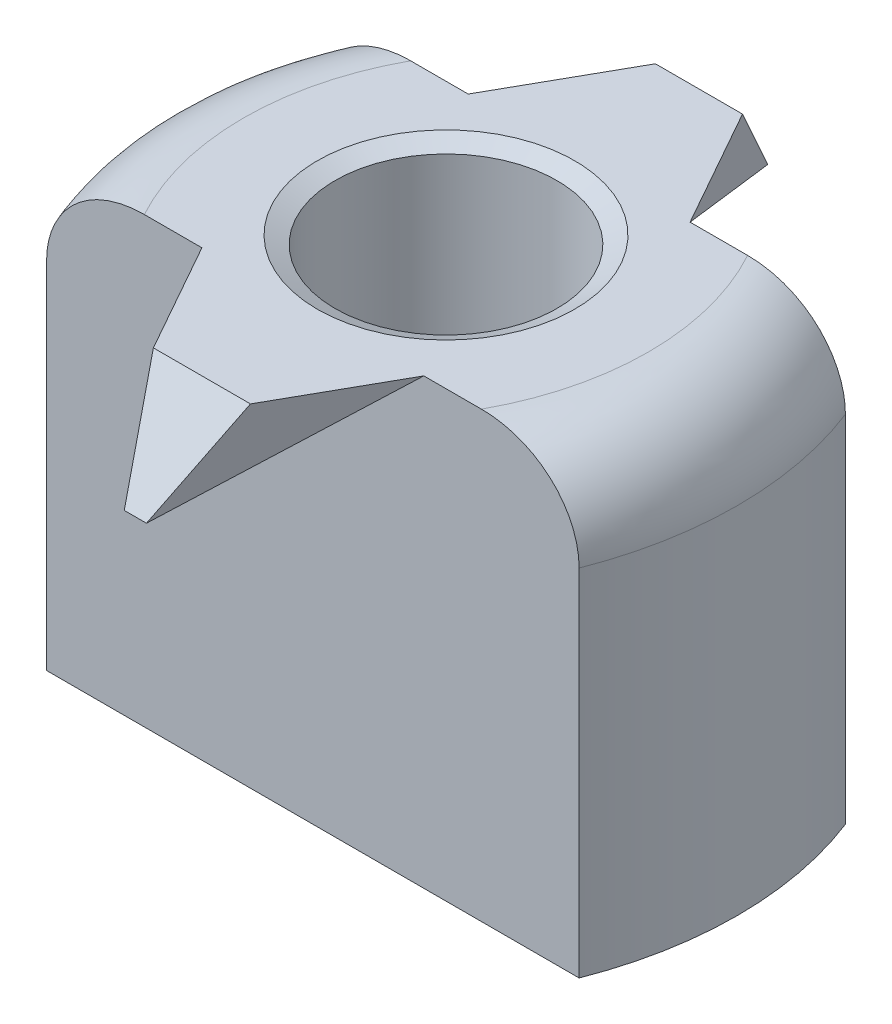
ISO-10303-21;
HEADER;
FILE_DESCRIPTION(('STEP AP214'),'2;1');
FILE_NAME('part.step','',(''),(''),'','','');
FILE_SCHEMA(('AUTOMOTIVE_DESIGN { 1 0 10303 214 1 1 1 1 }'));
ENDSEC;
DATA;
#1=APPLICATION_CONTEXT('core data for automotive mechanical design processes');
#2=APPLICATION_PROTOCOL_DEFINITION('international standard','automotive_design',2000,#1);
#3=PRODUCT_CONTEXT('',#1,'mechanical');
#4=PRODUCT('Part','Part','',(#3));
#5=PRODUCT_RELATED_PRODUCT_CATEGORY('part','',(#4));
#6=PRODUCT_DEFINITION_FORMATION('','',#4);
#7=PRODUCT_DEFINITION_CONTEXT('part definition',#1,'design');
#8=PRODUCT_DEFINITION('design','',#6,#7);
#9=PRODUCT_DEFINITION_SHAPE('','',#8);
#10=(LENGTH_UNIT() NAMED_UNIT(*) SI_UNIT(.MILLI.,.METRE.));
#11=(NAMED_UNIT(*) PLANE_ANGLE_UNIT() SI_UNIT($,.RADIAN.));
#12=(NAMED_UNIT(*) SI_UNIT($,.STERADIAN.) SOLID_ANGLE_UNIT());
#13=UNCERTAINTY_MEASURE_WITH_UNIT(LENGTH_MEASURE(1.E-05),#10,'distance_accuracy_value','');
#14=(GEOMETRIC_REPRESENTATION_CONTEXT(3) GLOBAL_UNCERTAINTY_ASSIGNED_CONTEXT((#13)) GLOBAL_UNIT_ASSIGNED_CONTEXT((#10,
#11,#12)) REPRESENTATION_CONTEXT('',''));
#15=CARTESIAN_POINT('',(0.,0.,0.));
#16=DIRECTION('',(0.,0.,1.));
#17=DIRECTION('',(1.,0.,0.));
#18=AXIS2_PLACEMENT_3D('',#15,#16,#17);
#19=CARTESIAN_POINT('',(2.00869459776592,8.,23.889910232699));
#20=DIRECTION('',(-0.871575537124549,0.,-0.49026123963256));
#21=DIRECTION('',(-0.490261239632559,0.,0.871575537124549));
#22=AXIS2_PLACEMENT_3D('',#19,#20,#21);
#23=PLANE('',#22);
#24=DIRECTION('',(-0.49026123963256,0.,0.871575537124549));
#25=VECTOR('',#24,1.);
#26=CARTESIAN_POINT('',(2.00869459776592,10.,23.889910232699));
#27=LINE('',#26,#25);
#28=CARTESIAN_POINT('',(7.35801361324972,10.,14.3800097607278));
#29=VERTEX_POINT('',#28);
#30=CARTESIAN_POINT('',(5.9517636132497,10.,16.8800097607279));
#31=VERTEX_POINT('',#30);
#32=EDGE_CURVE('E176',#29,#31,#27,.T.);
#33=ORIENTED_EDGE('',*,*,#32,.T.);
#34=DIRECTION('',(-0.319778644158178,-0.757993823189763,0.568495367392316));
#35=VECTOR('',#34,1.);
#36=CARTESIAN_POINT('',(3.78942270653598,4.87445118408593,20.7241713726634));
#37=LINE('',#36,#35);
#38=CARTESIAN_POINT('',(5.10801361324971,8.,18.3800097607278));
#39=VERTEX_POINT('',#38);
#40=EDGE_CURVE('E549',#31,#39,#37,.T.);
#41=ORIENTED_EDGE('',*,*,#40,.T.);
#42=DIRECTION('',(0.449438552495031,0.399500935551138,-0.799001871102275));
#43=VECTOR('',#42,1.);
#44=CARTESIAN_POINT('',(5.10801361324971,8.,18.3800097607278));
#45=LINE('',#44,#43);
#46=EDGE_CURVE('E164',#39,#29,#45,.T.);
#47=ORIENTED_EDGE('',*,*,#46,.T.);
#48=EDGE_LOOP('',(#33,#41,#47));
#49=FACE_BOUND('',#48,.T.);
#50=ADVANCED_FACE('F37',(#49),#23,.F.);
#51=CARTESIAN_POINT('',(0.,8.,22.7600195214557));
#52=DIRECTION('',(0.,1.,0.));
#53=DIRECTION('',(0.,0.,-1.));
#54=AXIS2_PLACEMENT_3D('',#51,#52,#53);
#55=PLANE('',#54);
#56=DIRECTION('',(-1.,0.,0.));
#57=VECTOR('',#56,1.);
#58=CARTESIAN_POINT('',(0.,8.,18.3800097607278));
#59=LINE('',#58,#57);
#60=CARTESIAN_POINT('',(4.60801361324971,8.,18.3800097607278));
#61=VERTEX_POINT('',#60);
#62=EDGE_CURVE('E144',#39,#61,#59,.T.);
#63=ORIENTED_EDGE('',*,*,#62,.T.);
#64=DIRECTION('',(0.,0.,1.));
#65=VECTOR('',#64,1.);
#66=CARTESIAN_POINT('',(4.60801361324972,8.,14.3800097607278));
#67=LINE('',#66,#65);
#68=CARTESIAN_POINT('',(4.60801361324972,8.,14.3800097607278));
#69=VERTEX_POINT('',#68);
#70=EDGE_CURVE('E156',#69,#61,#67,.T.);
#71=ORIENTED_EDGE('',*,*,#70,.F.);
#72=DIRECTION('',(-1.,0.,0.));
#73=VECTOR('',#72,1.);
#74=CARTESIAN_POINT('',(0.,8.,14.3800097607278));
#75=LINE('',#74,#73);
#76=CARTESIAN_POINT('',(5.10801361324972,8.,14.3800097607278));
#77=VERTEX_POINT('',#76);
#78=EDGE_CURVE('E172',#77,#69,#75,.T.);
#79=ORIENTED_EDGE('',*,*,#78,.F.);
#80=DIRECTION('',(0.,0.,1.));
#81=VECTOR('',#80,1.);
#82=CARTESIAN_POINT('',(5.10801361324972,8.,14.3800097607278));
#83=LINE('',#82,#81);
#84=EDGE_CURVE('E171',#77,#39,#83,.T.);
#85=ORIENTED_EDGE('',*,*,#84,.T.);
#86=EDGE_LOOP('',(#63,#71,#79,#85));
#87=FACE_BOUND('',#86,.T.);
#88=ADVANCED_FACE('F170',(#87),#55,.F.);
#89=CARTESIAN_POINT('',(0.,10.,14.3800097607278));
#90=DIRECTION('',(0.,0.,-1.));
#91=DIRECTION('',(-1.,0.,0.));
#92=AXIS2_PLACEMENT_3D('',#89,#90,#91);
#93=PLANE('',#92);
#94=DIRECTION('',(1.,0.,0.));
#95=VECTOR('',#94,1.);
#96=CARTESIAN_POINT('',(0.,10.,14.3800097607278));
#97=LINE('',#96,#95);
#98=CARTESIAN_POINT('',(1.06067829011155,10.,14.3800097607278));
#99=VERTEX_POINT('',#98);
#100=CARTESIAN_POINT('',(2.35801361324972,10.,14.3800097607278));
#101=VERTEX_POINT('',#100);
#102=EDGE_CURVE('E221',#99,#101,#97,.T.);
#103=ORIENTED_EDGE('',*,*,#102,.F.);
#104=CARTESIAN_POINT('',(1.06067829011155,10.,14.3800097607278));
#105=CARTESIAN_POINT('',(0.99276883689392,9.99999692601503,14.3800097607278));
#106=CARTESIAN_POINT('',(0.92488186949415,9.99733748987795,14.3800097607278));
#107=CARTESIAN_POINT('',(0.789507985505643,9.98657300168965,14.3800097607278));
#108=CARTESIAN_POINT('',(0.722021293302987,9.97846514174542,14.3800097607278));
#109=CARTESIAN_POINT('',(0.52034416207622,9.9456993105509,14.3800097607278));
#110=CARTESIAN_POINT('',(0.387403950018559,9.91259718921953,14.3800097607278));
#111=CARTESIAN_POINT('',(0.128937050575934,9.82342949452416,14.3800097607278));
#112=CARTESIAN_POINT('',(0.00343710516430207,9.76728623026918,14.3800097607278));
#113=CARTESIAN_POINT('',(-0.23475568878166,9.63267396275602,14.3800097607278));
#114=CARTESIAN_POINT('',(-0.347475288661054,9.55425284454722,14.3800097607278));
#115=CARTESIAN_POINT('',(-0.545654084046089,9.38515579847209,14.3800097607278));
#116=CARTESIAN_POINT('',(-0.63267696886292,9.29631242483982,14.3800097607278));
#117=CARTESIAN_POINT('',(-0.788821780296559,9.10396165368204,14.3800097607278));
#118=CARTESIAN_POINT('',(-0.857941879908584,9.00045276118558,14.3800097607278));
#119=CARTESIAN_POINT('',(-0.969851523633459,8.79194153031789,14.3800097607278));
#120=CARTESIAN_POINT('',(-1.01444435063803,8.68790251467548,14.3800097607278));
#121=CARTESIAN_POINT('',(-1.08433422877968,8.47363160828245,14.3800097607278));
#122=CARTESIAN_POINT('',(-1.10966733215311,8.36341170506273,14.3800097607278));
#123=CARTESIAN_POINT('',(-1.13057764239597,8.210183368668,14.3800097607278));
#124=CARTESIAN_POINT('',(-1.13485643257881,8.16822642104922,14.3800097607278));
#125=CARTESIAN_POINT('',(-1.14055727489586,8.08418663444331,14.3800097607278));
#126=CARTESIAN_POINT('',(-1.14198391054801,8.04210410646292,14.3800097607278));
#127=CARTESIAN_POINT('',(-1.14198638675049,8.00000000000003,14.3800097607278));
#128=B_SPLINE_CURVE_WITH_KNOTS('',3,(#104,#105,#106,#107,#108,#109,#110,#111,#112,#113,#114,
#115,#116,#117,#118,#119,#120,#121,#122,#123,#124,#125,#126,#127),.UNSPECIFIED.,.F.,.F.,(4,2,2,
2,2,2,2,2,2,2,2,4),(0.,0.203624834366503,0.407354689139029,0.816199548109344,1.22643444030561,
1.63579414124467,2.0068611863635,2.377966084497,2.71584732346191,3.05309451528966,
3.17954307435226,3.30578826202666),.UNSPECIFIED.);
#129=CARTESIAN_POINT('',(-1.14198638675029,8.,14.3800097607278));
#130=VERTEX_POINT('',#129);
#131=EDGE_CURVE('E236',#99,#130,#128,.T.);
#132=ORIENTED_EDGE('',*,*,#131,.T.);
#133=DIRECTION('',(0.,-1.,0.));
#134=VECTOR('',#133,1.);
#135=CARTESIAN_POINT('',(-1.14198638675029,10.,14.3800097607278));
#136=LINE('',#135,#134);
#137=CARTESIAN_POINT('',(-1.14198638675029,0.,14.3800097607278));
#138=VERTEX_POINT('',#137);
#139=EDGE_CURVE('E348',#130,#138,#136,.T.);
#140=ORIENTED_EDGE('',*,*,#139,.T.);
#141=DIRECTION('',(1.,0.,0.));
#142=VECTOR('',#141,1.);
#143=CARTESIAN_POINT('',(0.,0.,14.3800097607278));
#144=LINE('',#143,#142);
#145=CARTESIAN_POINT('',(10.8580136132497,0.,14.3800097607278));
#146=VERTEX_POINT('',#145);
#147=EDGE_CURVE('E340',#138,#146,#144,.T.);
#148=ORIENTED_EDGE('',*,*,#147,.T.);
#149=DIRECTION('',(0.,-1.,0.));
#150=VECTOR('',#149,1.);
#151=CARTESIAN_POINT('',(10.8580136132497,10.,14.3800097607278));
#152=LINE('',#151,#150);
#153=CARTESIAN_POINT('',(10.8580136132497,8.,14.3800097607278));
#154=VERTEX_POINT('',#153);
#155=EDGE_CURVE('E338',#154,#146,#152,.T.);
#156=ORIENTED_EDGE('',*,*,#155,.F.);
#157=CARTESIAN_POINT('',(10.8580136132497,8.,14.3800097607278));
#158=CARTESIAN_POINT('',(10.8580147380313,8.05327186211022,14.3800097607278));
#159=CARTESIAN_POINT('',(10.8557269651468,8.10651739083268,14.3800097607278));
#160=CARTESIAN_POINT('',(10.8466103537661,8.21261002598222,14.3800097607278));
#161=CARTESIAN_POINT('',(10.8397822208703,8.26545719302682,14.3800097607278));
#162=CARTESIAN_POINT('',(10.8125996787241,8.4225700623657,14.3800097607278));
#163=CARTESIAN_POINT('',(10.7855465724581,8.52575398372436,14.3800097607278));
#164=CARTESIAN_POINT('',(10.7145624841592,8.72605905107867,14.3800097607278));
#165=CARTESIAN_POINT('',(10.6706322116999,8.82318045176383,14.3800097607278));
#166=CARTESIAN_POINT('',(10.5674394402873,9.00892490803404,14.3800097607278));
#167=CARTESIAN_POINT('',(10.5081726640865,9.09754558335815,14.3800097607278));
#168=CARTESIAN_POINT('',(10.3747434638435,9.26612414393127,14.3800097607278));
#169=CARTESIAN_POINT('',(10.3002662613742,9.34583219594043,14.3800097607278));
#170=CARTESIAN_POINT('',(10.1397174493249,9.49250416769284,14.3800097607278));
#171=CARTESIAN_POINT('',(10.0536451812793,9.55946736315437,14.3800097607278));
#172=CARTESIAN_POINT('',(9.86659452718773,9.6834234262263,14.3800097607278));
#173=CARTESIAN_POINT('',(9.7650155905292,9.73950812521485,14.3800097607278));
#174=CARTESIAN_POINT('',(9.55438703283936,9.83545687418496,14.3800097607278));
#175=CARTESIAN_POINT('',(9.44532968958661,9.87530385317837,14.3800097607278));
#176=CARTESIAN_POINT('',(9.22365750048641,9.93830341075953,14.3800097607278));
#177=CARTESIAN_POINT('',(9.1110855237923,9.96160880483585,14.3800097607278));
#178=CARTESIAN_POINT('',(8.88408768012567,9.99245981527619,14.3800097607278));
#179=CARTESIAN_POINT('',(8.76966744730727,10.0000465892978,14.3800097607278));
#180=CARTESIAN_POINT('',(8.65534893638787,10.,14.3800097607278));
#181=B_SPLINE_CURVE_WITH_KNOTS('',3,(#157,#158,#159,#160,#161,#162,#163,#164,#165,#166,#167,
#168,#169,#170,#171,#172,#173,#174,#175,#176,#177,#178,#179,#180),.UNSPECIFIED.,.F.,.F.,(4,2,2,
2,2,2,2,2,2,2,2,4),(0.,0.159714590734423,0.319404366618723,0.637756986697413,0.956096223611161,
1.27452433905786,1.60036881631641,1.92623180557445,2.27287591243301,2.619883517664,
2.9636421117136,3.30649946432476),.UNSPECIFIED.);
#182=CARTESIAN_POINT('',(8.65534893638787,10.,14.3800097607278));
#183=VERTEX_POINT('',#182);
#184=EDGE_CURVE('E230',#154,#183,#181,.T.);
#185=ORIENTED_EDGE('',*,*,#184,.T.);
#186=EDGE_CURVE('E218',#29,#183,#97,.T.);
#187=ORIENTED_EDGE('',*,*,#186,.F.);
#188=DIRECTION('',(-0.74740931868366,-0.66436383882992,0.));
#189=VECTOR('',#188,1.);
#190=CARTESIAN_POINT('',(7.35801361324972,10.,14.3800097607278));
#191=LINE('',#190,#189);
#192=EDGE_CURVE('E535',#29,#77,#191,.T.);
#193=ORIENTED_EDGE('',*,*,#192,.T.);
#194=ORIENTED_EDGE('',*,*,#78,.T.);
#195=DIRECTION('',(0.747409318683659,-0.66436383882992,0.));
#196=VECTOR('',#195,1.);
#197=CARTESIAN_POINT('',(2.35801361324972,10.,14.3800097607278));
#198=LINE('',#197,#196);
#199=EDGE_CURVE('E160',#101,#69,#198,.T.);
#200=ORIENTED_EDGE('',*,*,#199,.F.);
#201=EDGE_LOOP('',(#103,#132,#140,#148,#156,#185,#187,#193,#194,#200));
#202=FACE_BOUND('',#201,.T.);
#203=ADVANCED_FACE('F241',(#202),#93,.F.);
#204=CARTESIAN_POINT('',(2.00869459776592,8.,-1.12989071124333));
#205=DIRECTION('',(0.871575537124549,0.,-0.490261239632559));
#206=DIRECTION('',(-0.490261239632559,0.,-0.871575537124549));
#207=AXIS2_PLACEMENT_3D('',#204,#205,#206);
#208=PLANE('',#207);
#209=DIRECTION('',(-0.490261239632559,0.,-0.871575537124549));
#210=VECTOR('',#209,1.);
#211=CARTESIAN_POINT('',(2.00869459776592,10.,-1.12989071124333));
#212=LINE('',#211,#210);
#213=CARTESIAN_POINT('',(7.35801361324972,10.,8.38000976072784));
#214=VERTEX_POINT('',#213);
#215=CARTESIAN_POINT('',(5.83926361324971,10.,5.68000976072785));
#216=VERTEX_POINT('',#215);
#217=EDGE_CURVE('E199',#214,#216,#212,.T.);
#218=ORIENTED_EDGE('',*,*,#217,.F.);
#219=DIRECTION('',(0.44943855249503,0.399500935551138,0.799001871102276));
#220=VECTOR('',#219,1.);
#221=CARTESIAN_POINT('',(5.10801361324972,8.,4.38000976072785));
#222=LINE('',#221,#220);
#223=CARTESIAN_POINT('',(5.10801361324972,8.,4.38000976072785));
#224=VERTEX_POINT('',#223);
#225=EDGE_CURVE('E569',#224,#214,#222,.T.);
#226=ORIENTED_EDGE('',*,*,#225,.F.);
#227=DIRECTION('',(-0.293093198103598,-0.801622422163686,-0.521054574406396));
#228=VECTOR('',#227,1.);
#229=CARTESIAN_POINT('',(5.10801361324971,8.,4.38000976072785));
#230=LINE('',#229,#228);
#231=EDGE_CURVE('E186',#216,#224,#230,.T.);
#232=ORIENTED_EDGE('',*,*,#231,.F.);
#233=EDGE_LOOP('',(#218,#226,#232));
#234=FACE_BOUND('',#233,.T.);
#235=ADVANCED_FACE('F246',(#234),#208,.T.);
#236=CARTESIAN_POINT('',(0.,8.,0.));
#237=DIRECTION('',(0.,1.,0.));
#238=DIRECTION('',(0.,0.,1.));
#239=AXIS2_PLACEMENT_3D('',#236,#237,#238);
#240=PLANE('',#239);
#241=DIRECTION('',(-1.,0.,0.));
#242=VECTOR('',#241,1.);
#243=CARTESIAN_POINT('',(0.,8.,8.38000976072785));
#244=LINE('',#243,#242);
#245=CARTESIAN_POINT('',(5.10801361324971,8.,8.38000976072785));
#246=VERTEX_POINT('',#245);
#247=CARTESIAN_POINT('',(4.60801361324972,8.,8.38000976072785));
#248=VERTEX_POINT('',#247);
#249=EDGE_CURVE('E198',#246,#248,#244,.T.);
#250=ORIENTED_EDGE('',*,*,#249,.T.);
#251=DIRECTION('',(0.,0.,-1.));
#252=VECTOR('',#251,1.);
#253=CARTESIAN_POINT('',(4.60801361324972,8.,8.38000976072785));
#254=LINE('',#253,#252);
#255=CARTESIAN_POINT('',(4.60801361324972,8.,4.38000976072785));
#256=VERTEX_POINT('',#255);
#257=EDGE_CURVE('E180',#248,#256,#254,.T.);
#258=ORIENTED_EDGE('',*,*,#257,.T.);
#259=DIRECTION('',(-1.,0.,0.));
#260=VECTOR('',#259,1.);
#261=CARTESIAN_POINT('',(0.,8.,4.38000976072785));
#262=LINE('',#261,#260);
#263=EDGE_CURVE('E195',#224,#256,#262,.T.);
#264=ORIENTED_EDGE('',*,*,#263,.F.);
#265=DIRECTION('',(0.,0.,-1.));
#266=VECTOR('',#265,1.);
#267=CARTESIAN_POINT('',(5.10801361324972,8.,8.38000976072785));
#268=LINE('',#267,#266);
#269=EDGE_CURVE('E184',#246,#224,#268,.T.);
#270=ORIENTED_EDGE('',*,*,#269,.F.);
#271=EDGE_LOOP('',(#250,#258,#264,#270));
#272=FACE_BOUND('',#271,.T.);
#273=ADVANCED_FACE('F258',(#272),#240,.F.);
#274=CARTESIAN_POINT('',(0.,10.,8.38000976072785));
#275=DIRECTION('',(0.,0.,1.));
#276=DIRECTION('',(1.,0.,0.));
#277=AXIS2_PLACEMENT_3D('',#274,#275,#276);
#278=PLANE('',#277);
#279=DIRECTION('',(0.,-1.,0.));
#280=VECTOR('',#279,1.);
#281=CARTESIAN_POINT('',(-1.14198638675029,10.,8.38000976072785));
#282=LINE('',#281,#280);
#283=CARTESIAN_POINT('',(-1.14198638675029,8.,8.38000976072785));
#284=VERTEX_POINT('',#283);
#285=CARTESIAN_POINT('',(-1.14198638675029,0.,8.38000976072785));
#286=VERTEX_POINT('',#285);
#287=EDGE_CURVE('E350',#284,#286,#282,.T.);
#288=ORIENTED_EDGE('',*,*,#287,.F.);
#289=CARTESIAN_POINT('',(-1.14198638675029,8.,8.38000976072785));
#290=CARTESIAN_POINT('',(-1.14198751153186,8.05327186211023,8.38000976072785));
#291=CARTESIAN_POINT('',(-1.1396997386474,8.10651739083268,8.38000976072785));
#292=CARTESIAN_POINT('',(-1.13058312726668,8.21261002598222,8.38000976072785));
#293=CARTESIAN_POINT('',(-1.12375499437085,8.26545719302682,8.38000976072785));
#294=CARTESIAN_POINT('',(-1.09657245222467,8.4225700623657,8.38000976072785));
#295=CARTESIAN_POINT('',(-1.06951934595863,8.52575398372436,8.38000976072785));
#296=CARTESIAN_POINT('',(-0.998535257659743,8.72605905107867,8.38000976072785));
#297=CARTESIAN_POINT('',(-0.954604985200508,8.82318045176383,8.38000976072785));
#298=CARTESIAN_POINT('',(-0.851412213787884,9.00892490803404,8.38000976072785));
#299=CARTESIAN_POINT('',(-0.792145437587028,9.09754558335816,8.38000976072785));
#300=CARTESIAN_POINT('',(-0.65871623734411,9.26612414393127,8.38000976072785));
#301=CARTESIAN_POINT('',(-0.584239034874814,9.34583219594043,8.38000976072785));
#302=CARTESIAN_POINT('',(-0.423690222825438,9.49250416769284,8.38000976072785));
#303=CARTESIAN_POINT('',(-0.337617954779908,9.55946736315437,8.38000976072785));
#304=CARTESIAN_POINT('',(-0.1505673006883,9.6834234262263,8.38000976072785));
#305=CARTESIAN_POINT('',(-0.0489883640297697,9.73950812521485,8.38000976072785));
#306=CARTESIAN_POINT('',(0.161640193660069,9.83545687418496,8.38000976072785));
#307=CARTESIAN_POINT('',(0.270697536912813,9.87530385317837,8.38000976072785));
#308=CARTESIAN_POINT('',(0.492369726013018,9.93830341075953,8.38000976072785));
#309=CARTESIAN_POINT('',(0.604941702707128,9.96160880483585,8.38000976072785));
#310=CARTESIAN_POINT('',(0.831939546373754,9.99245981527619,8.38000976072785));
#311=CARTESIAN_POINT('',(0.946359779192156,10.0000465892978,8.38000976072785));
#312=CARTESIAN_POINT('',(1.06067829011155,10.,8.38000976072785));
#313=B_SPLINE_CURVE_WITH_KNOTS('',3,(#289,#290,#291,#292,#293,#294,#295,#296,#297,#298,#299,
#300,#301,#302,#303,#304,#305,#306,#307,#308,#309,#310,#311,#312),.UNSPECIFIED.,.F.,.F.,(4,2,2,
2,2,2,2,2,2,2,2,4),(0.,0.159714590734423,0.319404366618724,0.637756986697413,0.956096223611161,
1.27452433905786,1.60036881631641,1.92623180557445,2.27287591243301,2.619883517664,
2.96364211171361,3.30649946432476),.UNSPECIFIED.);
#314=CARTESIAN_POINT('',(1.06067829011155,10.,8.38000976072785));
#315=VERTEX_POINT('',#314);
#316=EDGE_CURVE('E46',#284,#315,#313,.T.);
#317=ORIENTED_EDGE('',*,*,#316,.T.);
#318=DIRECTION('',(-1.,0.,0.));
#319=VECTOR('',#318,1.);
#320=CARTESIAN_POINT('',(0.,10.,8.38000976072785));
#321=LINE('',#320,#319);
#322=CARTESIAN_POINT('',(2.35801361324971,10.,8.38000976072785));
#323=VERTEX_POINT('',#322);
#324=EDGE_CURVE('E212',#323,#315,#321,.T.);
#325=ORIENTED_EDGE('',*,*,#324,.F.);
#326=DIRECTION('',(0.747409318683659,-0.66436383882992,0.));
#327=VECTOR('',#326,1.);
#328=CARTESIAN_POINT('',(2.35801361324972,10.,8.38000976072785));
#329=LINE('',#328,#327);
#330=EDGE_CURVE('E174',#323,#248,#329,.T.);
#331=ORIENTED_EDGE('',*,*,#330,.T.);
#332=ORIENTED_EDGE('',*,*,#249,.F.);
#333=DIRECTION('',(-0.74740931868366,-0.66436383882992,0.));
#334=VECTOR('',#333,1.);
#335=CARTESIAN_POINT('',(7.35801361324972,10.,8.38000976072784));
#336=LINE('',#335,#334);
#337=EDGE_CURVE('E187',#214,#246,#336,.T.);
#338=ORIENTED_EDGE('',*,*,#337,.F.);
#339=CARTESIAN_POINT('',(8.65534893638787,10.,8.38000976072784));
#340=VERTEX_POINT('',#339);
#341=EDGE_CURVE('E216',#340,#214,#321,.T.);
#342=ORIENTED_EDGE('',*,*,#341,.F.);
#343=CARTESIAN_POINT('',(8.65534893638787,10.,8.38000976072785));
#344=CARTESIAN_POINT('',(8.72325838960551,9.99999692601503,8.38000976072784));
#345=CARTESIAN_POINT('',(8.79114535700528,9.99733748987795,8.38000976072784));
#346=CARTESIAN_POINT('',(8.92651924099378,9.98657300168965,8.38000976072784));
#347=CARTESIAN_POINT('',(8.99400593319644,9.97846514174542,8.38000976072784));
#348=CARTESIAN_POINT('',(9.19568306442321,9.9456993105509,8.38000976072784));
#349=CARTESIAN_POINT('',(9.32862327648087,9.91259718921953,8.38000976072784));
#350=CARTESIAN_POINT('',(9.58709017592349,9.82342949452416,8.38000976072784));
#351=CARTESIAN_POINT('',(9.71259012133513,9.76728623026918,8.38000976072784));
#352=CARTESIAN_POINT('',(9.95078291528109,9.63267396275602,8.38000976072784));
#353=CARTESIAN_POINT('',(10.0635025151605,9.55425284454722,8.38000976072784));
#354=CARTESIAN_POINT('',(10.2616813105455,9.38515579847209,8.38000976072784));
#355=CARTESIAN_POINT('',(10.3487041953623,9.29631242483982,8.38000976072784));
#356=CARTESIAN_POINT('',(10.504849006796,9.10396165368204,8.38000976072784));
#357=CARTESIAN_POINT('',(10.573969106408,9.00045276118558,8.38000976072784));
#358=CARTESIAN_POINT('',(10.6858787501329,8.79194153031789,8.38000976072784));
#359=CARTESIAN_POINT('',(10.7304715771375,8.68790251467548,8.38000976072784));
#360=CARTESIAN_POINT('',(10.8003614552791,8.47363160828245,8.38000976072784));
#361=CARTESIAN_POINT('',(10.8256945586525,8.36341170506273,8.38000976072784));
#362=CARTESIAN_POINT('',(10.8466048688954,8.210183368668,8.38000976072784));
#363=CARTESIAN_POINT('',(10.8508836590782,8.16822642104922,8.38000976072784));
#364=CARTESIAN_POINT('',(10.8565845013953,8.08418663444331,8.38000976072784));
#365=CARTESIAN_POINT('',(10.8580111370474,8.04210410646292,8.38000976072784));
#366=CARTESIAN_POINT('',(10.8580136132499,8.00000000000003,8.38000976072784));
#367=B_SPLINE_CURVE_WITH_KNOTS('',3,(#343,#344,#345,#346,#347,#348,#349,#350,#351,#352,#353,
#354,#355,#356,#357,#358,#359,#360,#361,#362,#363,#364,#365,#366),.UNSPECIFIED.,.F.,.F.,(4,2,2,
2,2,2,2,2,2,2,2,4),(0.,0.203624834366503,0.407354689139028,0.816199548109343,1.22643444030561,
1.63579414124467,2.0068611863635,2.377966084497,2.71584732346191,3.05309451528966,
3.17954307435226,3.30578826202666),.UNSPECIFIED.);
#368=CARTESIAN_POINT('',(10.8580136132497,8.,8.38000976072784));
#369=VERTEX_POINT('',#368);
#370=EDGE_CURVE('E53',#340,#369,#367,.T.);
#371=ORIENTED_EDGE('',*,*,#370,.T.);
#372=DIRECTION('',(0.,-1.,0.));
#373=VECTOR('',#372,1.);
#374=CARTESIAN_POINT('',(10.8580136132497,10.,8.38000976072784));
#375=LINE('',#374,#373);
#376=CARTESIAN_POINT('',(10.8580136132497,0.,8.38000976072784));
#377=VERTEX_POINT('',#376);
#378=EDGE_CURVE('E223',#369,#377,#375,.T.);
#379=ORIENTED_EDGE('',*,*,#378,.T.);
#380=DIRECTION('',(-1.,0.,0.));
#381=VECTOR('',#380,1.);
#382=CARTESIAN_POINT('',(0.,0.,8.38000976072785));
#383=LINE('',#382,#381);
#384=EDGE_CURVE('E205',#377,#286,#383,.T.);
#385=ORIENTED_EDGE('',*,*,#384,.T.);
#386=EDGE_LOOP('',(#288,#317,#325,#331,#332,#338,#342,#371,#379,#385));
#387=FACE_BOUND('',#386,.T.);
#388=ADVANCED_FACE('F254',(#387),#278,.F.);
#389=CARTESIAN_POINT('',(6.53709877974683,10.,11.3800097607278));
#390=DIRECTION('',(0.,-1.,0.));
#391=DIRECTION('',(0.,0.,-1.));
#392=AXIS2_PLACEMENT_3D('',#389,#390,#391);
#393=CYLINDRICAL_SURFACE('',#392,8.24429190375475);
#394=ORIENTED_EDGE('',*,*,#139,.F.);
#395=CARTESIAN_POINT('',(6.53709877974683,8.,11.3800097607278));
#396=DIRECTION('',(0.,1.,0.));
#397=DIRECTION('',(0.,0.,1.));
#398=AXIS2_PLACEMENT_3D('',#395,#396,#397);
#399=CIRCLE('',#398,8.24429190375475);
#400=EDGE_CURVE('E61',#130,#284,#399,.F.);
#401=ORIENTED_EDGE('',*,*,#400,.T.);
#402=ORIENTED_EDGE('',*,*,#287,.T.);
#403=CARTESIAN_POINT('',(6.53709877974683,0.,11.3800097607278));
#404=DIRECTION('',(0.,1.,0.));
#405=DIRECTION('',(0.,0.,1.));
#406=AXIS2_PLACEMENT_3D('',#403,#404,#405);
#407=CIRCLE('',#406,8.24429190375475);
#408=EDGE_CURVE('E334',#286,#138,#407,.T.);
#409=ORIENTED_EDGE('',*,*,#408,.T.);
#410=EDGE_LOOP('',(#394,#401,#402,#409));
#411=FACE_BOUND('',#410,.T.);
#412=ADVANCED_FACE('F250',(#411),#393,.T.);
#413=CARTESIAN_POINT('',(3.17892844675259,10.,11.3800097607278));
#414=DIRECTION('',(0.,-1.,0.));
#415=DIRECTION('',(0.,0.,-1.));
#416=AXIS2_PLACEMENT_3D('',#413,#414,#415);
#417=CYLINDRICAL_SURFACE('',#416,8.24429190375475);
#418=ORIENTED_EDGE('',*,*,#378,.F.);
#419=CARTESIAN_POINT('',(3.17892844675259,8.,11.3800097607278));
#420=DIRECTION('',(0.,1.,0.));
#421=DIRECTION('',(0.,0.,1.));
#422=AXIS2_PLACEMENT_3D('',#419,#420,#421);
#423=CIRCLE('',#422,8.24429190375475);
#424=EDGE_CURVE('E11',#369,#154,#423,.F.);
#425=ORIENTED_EDGE('',*,*,#424,.T.);
#426=ORIENTED_EDGE('',*,*,#155,.T.);
#427=CARTESIAN_POINT('',(3.17892844675259,0.,11.3800097607278));
#428=DIRECTION('',(0.,1.,0.));
#429=DIRECTION('',(0.,0.,1.));
#430=AXIS2_PLACEMENT_3D('',#427,#428,#429);
#431=CIRCLE('',#430,8.24429190375475);
#432=EDGE_CURVE('E332',#377,#146,#431,.F.);
#433=ORIENTED_EDGE('',*,*,#432,.F.);
#434=EDGE_LOOP('',(#418,#425,#426,#433));
#435=FACE_BOUND('',#434,.T.);
#436=ADVANCED_FACE('F248',(#435),#417,.T.);
#437=CARTESIAN_POINT('',(0.,10.,0.));
#438=DIRECTION('',(0.,1.,0.));
#439=DIRECTION('',(0.,0.,1.));
#440=AXIS2_PLACEMENT_3D('',#437,#438,#439);
#441=PLANE('',#440);
#442=ORIENTED_EDGE('',*,*,#324,.T.);
#443=CARTESIAN_POINT('',(6.53709877974683,10.,11.3800097607278));
#444=DIRECTION('',(0.,1.,0.));
#445=DIRECTION('',(0.,0.,1.));
#446=AXIS2_PLACEMENT_3D('',#443,#444,#445);
#447=CIRCLE('',#446,6.24429190375475);
#448=EDGE_CURVE('E226',#315,#99,#447,.T.);
#449=ORIENTED_EDGE('',*,*,#448,.T.);
#450=ORIENTED_EDGE('',*,*,#102,.T.);
#451=DIRECTION('',(-0.490261239632559,0.,-0.871575537124549));
#452=VECTOR('',#451,1.);
#453=CARTESIAN_POINT('',(5.37202638141465,10.,19.73825468191));
#454=LINE('',#453,#452);
#455=CARTESIAN_POINT('',(3.76426361324972,10.,16.8800097607278));
#456=VERTEX_POINT('',#455);
#457=EDGE_CURVE('E167',#456,#101,#454,.T.);
#458=ORIENTED_EDGE('',*,*,#457,.F.);
#459=DIRECTION('',(-1.,0.,0.));
#460=VECTOR('',#459,1.);
#461=CARTESIAN_POINT('',(7.76426361324972,10.,16.8800097607279));
#462=LINE('',#461,#460);
#463=EDGE_CURVE('E147',#31,#456,#462,.T.);
#464=ORIENTED_EDGE('',*,*,#463,.F.);
#465=ORIENTED_EDGE('',*,*,#32,.F.);
#466=ORIENTED_EDGE('',*,*,#186,.T.);
#467=CARTESIAN_POINT('',(3.17892844675259,10.,11.3800097607278));
#468=DIRECTION('',(0.,1.,0.));
#469=DIRECTION('',(0.,0.,1.));
#470=AXIS2_PLACEMENT_3D('',#467,#468,#469);
#471=CIRCLE('',#470,6.24429190375475);
#472=EDGE_CURVE('E224',#183,#340,#471,.T.);
#473=ORIENTED_EDGE('',*,*,#472,.T.);
#474=ORIENTED_EDGE('',*,*,#341,.T.);
#475=ORIENTED_EDGE('',*,*,#217,.T.);
#476=DIRECTION('',(1.,0.,0.));
#477=VECTOR('',#476,1.);
#478=CARTESIAN_POINT('',(3.83926361324971,10.,5.68000976072785));
#479=LINE('',#478,#477);
#480=CARTESIAN_POINT('',(3.87676361324971,10.,5.68000976072785));
#481=VERTEX_POINT('',#480);
#482=EDGE_CURVE('E190',#481,#216,#479,.T.);
#483=ORIENTED_EDGE('',*,*,#482,.F.);
#484=DIRECTION('',(-0.490261239632559,0.,0.871575537124549));
#485=VECTOR('',#484,1.);
#486=CARTESIAN_POINT('',(5.37202638141465,10.,3.02176483954574));
#487=LINE('',#486,#485);
#488=EDGE_CURVE('E194',#481,#323,#487,.T.);
#489=ORIENTED_EDGE('',*,*,#488,.T.);
#490=EDGE_LOOP('',(#442,#449,#450,#458,#464,#465,#466,#473,#474,#475,#483,#489));
#491=FACE_BOUND('',#490,.T.);
#492=CARTESIAN_POINT('',(4.85801361324971,10.,11.3800097607278));
#493=DIRECTION('',(0.,1.,0.));
#494=DIRECTION('',(0.,0.,1.));
#495=AXIS2_PLACEMENT_3D('',#492,#493,#494);
#496=CIRCLE('',#495,2.90000000000001);
#497=CARTESIAN_POINT('',(4.85801361324971,10.,14.2800097607279));
#498=VERTEX_POINT('',#497);
#499=EDGE_CURVE('E227',#498,#498,#496,.F.);
#500=ORIENTED_EDGE('',*,*,#499,.T.);
#501=EDGE_LOOP('',(#500));
#502=FACE_BOUND('',#501,.T.);
#503=ADVANCED_FACE('F317',(#491,#502),#441,.T.);
#504=CARTESIAN_POINT('',(0.,0.,0.));
#505=DIRECTION('',(0.,1.,0.));
#506=DIRECTION('',(0.,0.,1.));
#507=AXIS2_PLACEMENT_3D('',#504,#505,#506);
#508=PLANE('',#507);
#509=CARTESIAN_POINT('',(4.85801361324971,0.,11.3800097607278));
#510=DIRECTION('',(0.,1.,0.));
#511=DIRECTION('',(0.,0.,1.));
#512=AXIS2_PLACEMENT_3D('',#509,#510,#511);
#513=CIRCLE('',#512,2.5);
#514=CARTESIAN_POINT('',(4.85801361324971,0.,13.8800097607278));
#515=VERTEX_POINT('',#514);
#516=EDGE_CURVE('E202',#515,#515,#513,.T.);
#517=ORIENTED_EDGE('',*,*,#516,.T.);
#518=EDGE_LOOP('',(#517));
#519=FACE_BOUND('',#518,.T.);
#520=ORIENTED_EDGE('',*,*,#384,.F.);
#521=ORIENTED_EDGE('',*,*,#432,.T.);
#522=ORIENTED_EDGE('',*,*,#147,.F.);
#523=ORIENTED_EDGE('',*,*,#408,.F.);
#524=EDGE_LOOP('',(#520,#521,#522,#523));
#525=FACE_BOUND('',#524,.T.);
#526=ADVANCED_FACE('F315',(#519,#525),#508,.F.);
#527=CARTESIAN_POINT('',(4.85801361324971,0.,11.3800097607278));
#528=DIRECTION('',(0.,1.,0.));
#529=DIRECTION('',(0.,0.,1.));
#530=AXIS2_PLACEMENT_3D('',#527,#528,#529);
#531=CYLINDRICAL_SURFACE('',#530,2.5);
#532=CARTESIAN_POINT('',(4.85801361324971,9.813476936738,11.3800097607278));
#533=DIRECTION('',(0.,1.,0.));
#534=DIRECTION('',(0.,0.,1.));
#535=AXIS2_PLACEMENT_3D('',#532,#533,#534);
#536=CIRCLE('',#535,2.5);
#537=CARTESIAN_POINT('',(4.85801361324971,9.813476936738,13.8800097607278));
#538=VERTEX_POINT('',#537);
#539=EDGE_CURVE('E352',#538,#538,#536,.T.);
#540=ORIENTED_EDGE('',*,*,#539,.T.);
#541=EDGE_LOOP('',(#540));
#542=FACE_BOUND('',#541,.T.);
#543=ORIENTED_EDGE('',*,*,#516,.F.);
#544=EDGE_LOOP('',(#543));
#545=FACE_BOUND('',#544,.T.);
#546=ADVANCED_FACE('F312',(#542,#545),#531,.F.);
#547=CARTESIAN_POINT('',(4.85801361324971,9.813476936738,11.3800097607278));
#548=DIRECTION('',(0.,1.,0.));
#549=DIRECTION('',(0.,0.,1.));
#550=AXIS2_PLACEMENT_3D('',#547,#548,#549);
#551=CONICAL_SURFACE('',#550,2.5,1.13446401379632);
#552=ORIENTED_EDGE('',*,*,#499,.F.);
#553=EDGE_LOOP('',(#552));
#554=FACE_BOUND('',#553,.T.);
#555=ORIENTED_EDGE('',*,*,#539,.F.);
#556=EDGE_LOOP('',(#555));
#557=FACE_BOUND('',#556,.T.);
#558=ADVANCED_FACE('F259',(#554,#557),#551,.F.);
#559=CARTESIAN_POINT('',(5.37202638141465,8.,3.02176483954574));
#560=DIRECTION('',(-0.871575537124549,0.,-0.490261239632559));
#561=DIRECTION('',(-0.490261239632559,0.,0.871575537124549));
#562=AXIS2_PLACEMENT_3D('',#559,#560,#561);
#563=PLANE('',#562);
#564=DIRECTION('',(-0.44943855249503,0.399500935551138,0.799001871102276));
#565=VECTOR('',#564,1.);
#566=CARTESIAN_POINT('',(4.60801361324972,8.,4.38000976072785));
#567=LINE('',#566,#565);
#568=EDGE_CURVE('E183',#256,#323,#567,.T.);
#569=ORIENTED_EDGE('',*,*,#568,.T.);
#570=ORIENTED_EDGE('',*,*,#488,.F.);
#571=DIRECTION('',(-0.293093198103598,0.801622422163686,0.521054574406396));
#572=VECTOR('',#571,1.);
#573=CARTESIAN_POINT('',(4.88107291671622,7.25317113581811,3.89457099900962));
#574=LINE('',#573,#572);
#575=EDGE_CURVE('E192',#256,#481,#574,.T.);
#576=ORIENTED_EDGE('',*,*,#575,.F.);
#577=EDGE_LOOP('',(#569,#570,#576));
#578=FACE_BOUND('',#577,.T.);
#579=ADVANCED_FACE('F301',(#578),#563,.T.);
#580=CARTESIAN_POINT('',(3.10801361324971,8.,4.38000976072785));
#581=DIRECTION('',(0.,-0.544988350595414,0.838443616300637));
#582=DIRECTION('',(0.,-0.838443616300637,-0.544988350595414));
#583=AXIS2_PLACEMENT_3D('',#580,#581,#582);
#584=PLANE('',#583);
#585=ORIENTED_EDGE('',*,*,#575,.T.);
#586=ORIENTED_EDGE('',*,*,#482,.T.);
#587=ORIENTED_EDGE('',*,*,#231,.T.);
#588=ORIENTED_EDGE('',*,*,#263,.T.);
#589=EDGE_LOOP('',(#585,#586,#587,#588));
#590=FACE_BOUND('',#589,.T.);
#591=ADVANCED_FACE('F297',(#590),#584,.F.);
#592=CARTESIAN_POINT('',(-1.7178422672553,1.93257255066221,0.));
#593=DIRECTION('',(0.66436383882992,-0.74740931868366,0.));
#594=DIRECTION('',(0.74740931868366,0.66436383882992,0.));
#595=AXIS2_PLACEMENT_3D('',#592,#593,#594);
#596=PLANE('',#595);
#597=ORIENTED_EDGE('',*,*,#225,.T.);
#598=ORIENTED_EDGE('',*,*,#337,.T.);
#599=ORIENTED_EDGE('',*,*,#269,.T.);
#600=EDGE_LOOP('',(#597,#598,#599));
#601=FACE_BOUND('',#600,.T.);
#602=ADVANCED_FACE('F293',(#601),#596,.T.);
#603=CARTESIAN_POINT('',(6.00629566377919,6.75708262175158,0.));
#604=DIRECTION('',(0.66436383882992,0.747409318683659,0.));
#605=DIRECTION('',(-0.747409318683659,0.66436383882992,0.));
#606=AXIS2_PLACEMENT_3D('',#603,#604,#605);
#607=PLANE('',#606);
#608=ORIENTED_EDGE('',*,*,#330,.F.);
#609=ORIENTED_EDGE('',*,*,#568,.F.);
#610=ORIENTED_EDGE('',*,*,#257,.F.);
#611=EDGE_LOOP('',(#608,#609,#610));
#612=FACE_BOUND('',#611,.T.);
#613=ADVANCED_FACE('F290',(#612),#607,.F.);
#614=CARTESIAN_POINT('',(5.37202638141465,8.,19.73825468191));
#615=DIRECTION('',(0.871575537124549,0.,-0.490261239632559));
#616=DIRECTION('',(-0.490261239632559,0.,-0.871575537124549));
#617=AXIS2_PLACEMENT_3D('',#614,#615,#616);
#618=PLANE('',#617);
#619=DIRECTION('',(-0.44943855249503,0.399500935551138,-0.799001871102276));
#620=VECTOR('',#619,1.);
#621=CARTESIAN_POINT('',(4.60801361324971,8.,18.3800097607278));
#622=LINE('',#621,#620);
#623=EDGE_CURVE('E158',#61,#101,#622,.T.);
#624=ORIENTED_EDGE('',*,*,#623,.F.);
#625=DIRECTION('',(0.319778644158179,-0.75799382318976,0.568495367392318));
#626=VECTOR('',#625,1.);
#627=CARTESIAN_POINT('',(3.76426361324972,10.,16.8800097607278));
#628=LINE('',#627,#626);
#629=EDGE_CURVE('E140',#456,#61,#628,.T.);
#630=ORIENTED_EDGE('',*,*,#629,.F.);
#631=ORIENTED_EDGE('',*,*,#457,.T.);
#632=EDGE_LOOP('',(#624,#630,#631));
#633=FACE_BOUND('',#632,.T.);
#634=ADVANCED_FACE('F166',(#633),#618,.F.);
#635=CARTESIAN_POINT('',(-1.7178422672553,1.93257255066221,22.7600195214557));
#636=DIRECTION('',(0.66436383882992,-0.74740931868366,0.));
#637=DIRECTION('',(0.74740931868366,0.66436383882992,0.));
#638=AXIS2_PLACEMENT_3D('',#635,#636,#637);
#639=PLANE('',#638);
#640=ORIENTED_EDGE('',*,*,#46,.F.);
#641=ORIENTED_EDGE('',*,*,#84,.F.);
#642=ORIENTED_EDGE('',*,*,#192,.F.);
#643=EDGE_LOOP('',(#640,#641,#642));
#644=FACE_BOUND('',#643,.T.);
#645=ADVANCED_FACE('F390',(#644),#639,.T.);
#646=CARTESIAN_POINT('',(6.00629566377919,6.75708262175158,22.7600195214557));
#647=DIRECTION('',(0.66436383882992,0.747409318683659,0.));
#648=DIRECTION('',(-0.747409318683659,0.66436383882992,0.));
#649=AXIS2_PLACEMENT_3D('',#646,#647,#648);
#650=PLANE('',#649);
#651=ORIENTED_EDGE('',*,*,#199,.T.);
#652=ORIENTED_EDGE('',*,*,#70,.T.);
#653=ORIENTED_EDGE('',*,*,#623,.T.);
#654=EDGE_LOOP('',(#651,#652,#653));
#655=FACE_BOUND('',#654,.T.);
#656=ADVANCED_FACE('F157',(#655),#650,.F.);
#657=CARTESIAN_POINT('',(7.76426361324972,10.,16.8800097607279));
#658=DIRECTION('',(0.,-0.599999999999997,-0.800000000000002));
#659=DIRECTION('',(0.,0.800000000000002,-0.599999999999997));
#660=AXIS2_PLACEMENT_3D('',#657,#658,#659);
#661=PLANE('',#660);
#662=ORIENTED_EDGE('',*,*,#463,.T.);
#663=ORIENTED_EDGE('',*,*,#629,.T.);
#664=ORIENTED_EDGE('',*,*,#62,.F.);
#665=ORIENTED_EDGE('',*,*,#40,.F.);
#666=EDGE_LOOP('',(#662,#663,#664,#665));
#667=FACE_BOUND('',#666,.T.);
#668=ADVANCED_FACE('F142',(#667),#661,.F.);
#669=CARTESIAN_POINT('',(6.53709877974683,8.,11.3800097607278));
#670=DIRECTION('',(0.,1.,0.));
#671=DIRECTION('',(0.,0.,1.));
#672=AXIS2_PLACEMENT_3D('',#669,#670,#671);
#673=TOROIDAL_SURFACE('',#672,6.24429190375475,2.);
#674=ORIENTED_EDGE('',*,*,#316,.F.);
#675=ORIENTED_EDGE('',*,*,#400,.F.);
#676=ORIENTED_EDGE('',*,*,#131,.F.);
#677=ORIENTED_EDGE('',*,*,#448,.F.);
#678=EDGE_LOOP('',(#674,#675,#676,#677));
#679=FACE_BOUND('',#678,.T.);
#680=ADVANCED_FACE('F268',(#679),#673,.T.);
#681=CARTESIAN_POINT('',(3.17892844675259,8.,11.3800097607278));
#682=DIRECTION('',(0.,1.,0.));
#683=DIRECTION('',(0.,0.,1.));
#684=AXIS2_PLACEMENT_3D('',#681,#682,#683);
#685=TOROIDAL_SURFACE('',#684,6.24429190375475,2.);
#686=ORIENTED_EDGE('',*,*,#370,.F.);
#687=ORIENTED_EDGE('',*,*,#472,.F.);
#688=ORIENTED_EDGE('',*,*,#184,.F.);
#689=ORIENTED_EDGE('',*,*,#424,.F.);
#690=EDGE_LOOP('',(#686,#687,#688,#689));
#691=FACE_BOUND('',#690,.T.);
#692=ADVANCED_FACE('F39',(#691),#685,.T.);
#693=CLOSED_SHELL('',(#50,#88,#203,#235,#273,#388,#412,#436,#503,#526,#546,#558,#579,#591,#602,
#613,#634,#645,#656,#668,#680,#692));
#694=MANIFOLD_SOLID_BREP('B2',#693);
#695=ADVANCED_BREP_SHAPE_REPRESENTATION('',(#18,#694),#14);
#696=SHAPE_DEFINITION_REPRESENTATION(#9,#695);
ENDSEC;
END-ISO-10303-21;
